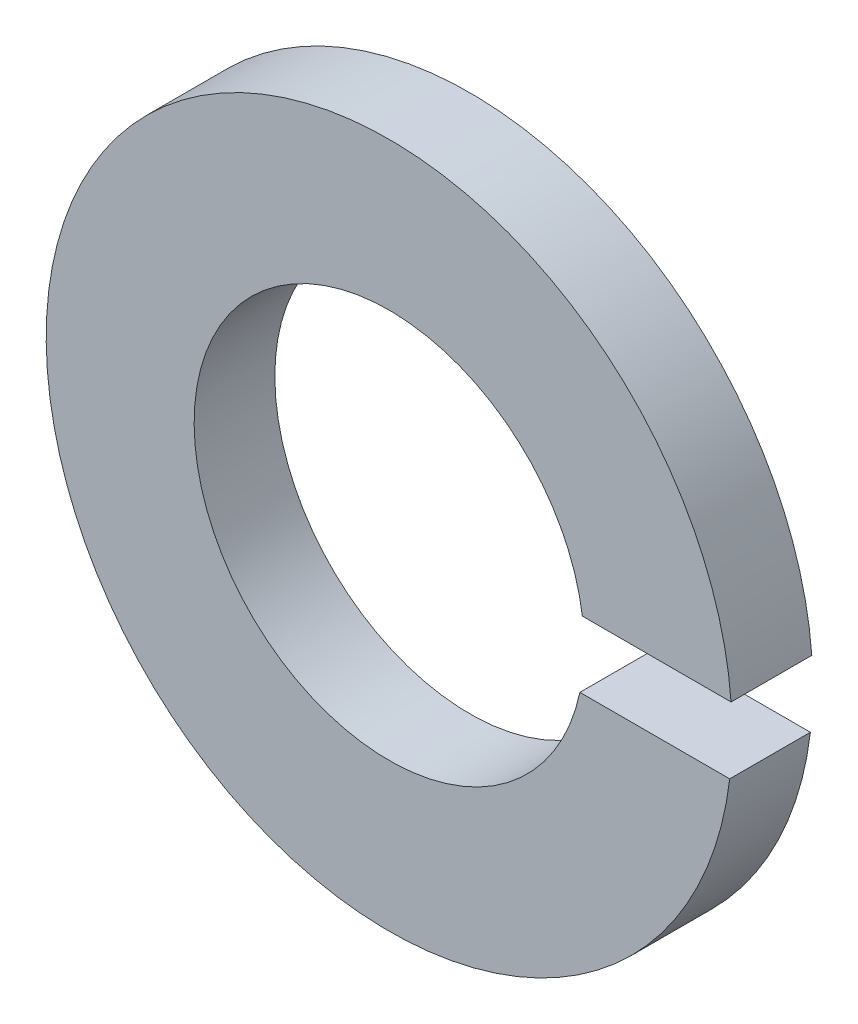
ISO-10303-21;
HEADER;
FILE_DESCRIPTION(('STEP AP214'),'2;1');
FILE_NAME('part.step','',(''),(''),'','','');
FILE_SCHEMA(('AUTOMOTIVE_DESIGN { 1 0 10303 214 1 1 1 1 }'));
ENDSEC;
DATA;
#1=APPLICATION_CONTEXT('core data for automotive mechanical design processes');
#2=APPLICATION_PROTOCOL_DEFINITION('international standard','automotive_design',2000,#1);
#3=PRODUCT_CONTEXT('',#1,'mechanical');
#4=PRODUCT('Part','Part','',(#3));
#5=PRODUCT_RELATED_PRODUCT_CATEGORY('part','',(#4));
#6=PRODUCT_DEFINITION_FORMATION('','',#4);
#7=PRODUCT_DEFINITION_CONTEXT('part definition',#1,'design');
#8=PRODUCT_DEFINITION('design','',#6,#7);
#9=PRODUCT_DEFINITION_SHAPE('','',#8);
#10=(LENGTH_UNIT() NAMED_UNIT(*) SI_UNIT(.MILLI.,.METRE.));
#11=(NAMED_UNIT(*) PLANE_ANGLE_UNIT() SI_UNIT($,.RADIAN.));
#12=(NAMED_UNIT(*) SI_UNIT($,.STERADIAN.) SOLID_ANGLE_UNIT());
#13=UNCERTAINTY_MEASURE_WITH_UNIT(LENGTH_MEASURE(1.E-05),#10,'distance_accuracy_value','');
#14=(GEOMETRIC_REPRESENTATION_CONTEXT(3) GLOBAL_UNCERTAINTY_ASSIGNED_CONTEXT((#13)) GLOBAL_UNIT_ASSIGNED_CONTEXT((#10,
#11,#12)) REPRESENTATION_CONTEXT('',''));
#15=CARTESIAN_POINT('',(0.,0.,0.));
#16=DIRECTION('',(0.,0.,1.));
#17=DIRECTION('',(1.,0.,0.));
#18=AXIS2_PLACEMENT_3D('',#15,#16,#17);
#19=CARTESIAN_POINT('',(0.,0.197779353039688,0.6));
#20=DIRECTION('',(0.,-1.,0.));
#21=DIRECTION('',(0.,0.,-1.));
#22=AXIS2_PLACEMENT_3D('',#19,#20,#21);
#23=PLANE('',#22);
#24=DIRECTION('',(-1.,0.,0.));
#25=VECTOR('',#24,1.);
#26=CARTESIAN_POINT('',(0.,0.197779353039688,0.));
#27=LINE('',#26,#25);
#28=CARTESIAN_POINT('',(2.54231849450678,0.197779353039688,0.));
#29=VERTEX_POINT('',#28);
#30=CARTESIAN_POINT('',(1.43644816387895,0.197779353039688,0.));
#31=VERTEX_POINT('',#30);
#32=EDGE_CURVE('E98',#29,#31,#27,.T.);
#33=ORIENTED_EDGE('',*,*,#32,.F.);
#34=DIRECTION('',(0.,0.,-1.));
#35=VECTOR('',#34,1.);
#36=CARTESIAN_POINT('',(2.54231849450678,0.197779353039688,0.6));
#37=LINE('',#36,#35);
#38=CARTESIAN_POINT('',(2.54231849450678,0.197779353039688,0.6));
#39=VERTEX_POINT('',#38);
#40=EDGE_CURVE('E11',#39,#29,#37,.T.);
#41=ORIENTED_EDGE('',*,*,#40,.F.);
#42=DIRECTION('',(-1.,0.,0.));
#43=VECTOR('',#42,1.);
#44=CARTESIAN_POINT('',(0.,0.197779353039688,0.6));
#45=LINE('',#44,#43);
#46=CARTESIAN_POINT('',(1.43644816387895,0.197779353039688,0.6));
#47=VERTEX_POINT('',#46);
#48=EDGE_CURVE('E83',#39,#47,#45,.T.);
#49=ORIENTED_EDGE('',*,*,#48,.T.);
#50=DIRECTION('',(0.,0.,-1.));
#51=VECTOR('',#50,1.);
#52=CARTESIAN_POINT('',(1.43644816387895,0.197779353039688,0.6));
#53=LINE('',#52,#51);
#54=EDGE_CURVE('E51',#47,#31,#53,.T.);
#55=ORIENTED_EDGE('',*,*,#54,.T.);
#56=EDGE_LOOP('',(#33,#41,#49,#55));
#57=FACE_BOUND('',#56,.T.);
#58=ADVANCED_FACE('F35',(#57),#23,.T.);
#59=CARTESIAN_POINT('',(0.,0.,0.6));
#60=DIRECTION('',(0.,0.,-1.));
#61=DIRECTION('',(-1.,0.,0.));
#62=AXIS2_PLACEMENT_3D('',#59,#60,#61);
#63=CYLINDRICAL_SURFACE('',#62,2.55);
#64=CARTESIAN_POINT('',(0.,0.,0.));
#65=DIRECTION('',(0.,0.,1.));
#66=DIRECTION('',(1.,0.,0.));
#67=AXIS2_PLACEMENT_3D('',#64,#65,#66);
#68=CIRCLE('',#67,2.55);
#69=CARTESIAN_POINT('',(2.53202738542672,-0.302220646960312,0.));
#70=VERTEX_POINT('',#69);
#71=EDGE_CURVE('E89',#29,#70,#68,.T.);
#72=ORIENTED_EDGE('',*,*,#71,.T.);
#73=DIRECTION('',(0.,0.,-1.));
#74=VECTOR('',#73,1.);
#75=CARTESIAN_POINT('',(2.53202738542672,-0.302220646960312,0.6));
#76=LINE('',#75,#74);
#77=CARTESIAN_POINT('',(2.53202738542672,-0.302220646960312,0.6));
#78=VERTEX_POINT('',#77);
#79=EDGE_CURVE('E43',#78,#70,#76,.T.);
#80=ORIENTED_EDGE('',*,*,#79,.F.);
#81=CARTESIAN_POINT('',(0.,0.,0.6));
#82=DIRECTION('',(0.,0.,1.));
#83=DIRECTION('',(1.,0.,0.));
#84=AXIS2_PLACEMENT_3D('',#81,#82,#83);
#85=CIRCLE('',#84,2.55);
#86=EDGE_CURVE('E77',#39,#78,#85,.T.);
#87=ORIENTED_EDGE('',*,*,#86,.F.);
#88=ORIENTED_EDGE('',*,*,#40,.T.);
#89=EDGE_LOOP('',(#72,#80,#87,#88));
#90=FACE_BOUND('',#89,.T.);
#91=ADVANCED_FACE('F87',(#90),#63,.T.);
#92=CARTESIAN_POINT('',(0.,-0.302220646960312,0.6));
#93=DIRECTION('',(0.,-1.,0.));
#94=DIRECTION('',(0.,0.,-1.));
#95=AXIS2_PLACEMENT_3D('',#92,#93,#94);
#96=PLANE('',#95);
#97=DIRECTION('',(-1.,0.,0.));
#98=VECTOR('',#97,1.);
#99=CARTESIAN_POINT('',(0.,-0.302220646960312,0.));
#100=LINE('',#99,#98);
#101=CARTESIAN_POINT('',(1.41815467440998,-0.302220646960312,0.));
#102=VERTEX_POINT('',#101);
#103=EDGE_CURVE('E101',#70,#102,#100,.T.);
#104=ORIENTED_EDGE('',*,*,#103,.T.);
#105=DIRECTION('',(0.,0.,-1.));
#106=VECTOR('',#105,1.);
#107=CARTESIAN_POINT('',(1.41815467440998,-0.302220646960312,0.6));
#108=LINE('',#107,#106);
#109=CARTESIAN_POINT('',(1.41815467440998,-0.302220646960312,0.6));
#110=VERTEX_POINT('',#109);
#111=EDGE_CURVE('E65',#110,#102,#108,.T.);
#112=ORIENTED_EDGE('',*,*,#111,.F.);
#113=DIRECTION('',(-1.,0.,0.));
#114=VECTOR('',#113,1.);
#115=CARTESIAN_POINT('',(0.,-0.302220646960312,0.6));
#116=LINE('',#115,#114);
#117=EDGE_CURVE('E82',#78,#110,#116,.T.);
#118=ORIENTED_EDGE('',*,*,#117,.F.);
#119=ORIENTED_EDGE('',*,*,#79,.T.);
#120=EDGE_LOOP('',(#104,#112,#118,#119));
#121=FACE_BOUND('',#120,.T.);
#122=ADVANCED_FACE('F92',(#121),#96,.F.);
#123=CARTESIAN_POINT('',(0.,0.,0.6));
#124=DIRECTION('',(0.,0.,-1.));
#125=DIRECTION('',(-1.,0.,0.));
#126=AXIS2_PLACEMENT_3D('',#123,#124,#125);
#127=CYLINDRICAL_SURFACE('',#126,1.45);
#128=CARTESIAN_POINT('',(0.,0.,0.));
#129=DIRECTION('',(0.,0.,1.));
#130=DIRECTION('',(1.,0.,0.));
#131=AXIS2_PLACEMENT_3D('',#128,#129,#130);
#132=CIRCLE('',#131,1.45);
#133=EDGE_CURVE('E103',#31,#102,#132,.T.);
#134=ORIENTED_EDGE('',*,*,#133,.F.);
#135=ORIENTED_EDGE('',*,*,#54,.F.);
#136=CARTESIAN_POINT('',(0.,0.,0.6));
#137=DIRECTION('',(0.,0.,1.));
#138=DIRECTION('',(1.,0.,0.));
#139=AXIS2_PLACEMENT_3D('',#136,#137,#138);
#140=CIRCLE('',#139,1.45);
#141=EDGE_CURVE('E93',#47,#110,#140,.T.);
#142=ORIENTED_EDGE('',*,*,#141,.T.);
#143=ORIENTED_EDGE('',*,*,#111,.T.);
#144=EDGE_LOOP('',(#134,#135,#142,#143));
#145=FACE_BOUND('',#144,.T.);
#146=ADVANCED_FACE('F108',(#145),#127,.F.);
#147=CARTESIAN_POINT('',(0.,0.,0.6));
#148=DIRECTION('',(0.,0.,1.));
#149=DIRECTION('',(1.,0.,0.));
#150=AXIS2_PLACEMENT_3D('',#147,#148,#149);
#151=PLANE('',#150);
#152=ORIENTED_EDGE('',*,*,#48,.F.);
#153=ORIENTED_EDGE('',*,*,#86,.T.);
#154=ORIENTED_EDGE('',*,*,#117,.T.);
#155=ORIENTED_EDGE('',*,*,#141,.F.);
#156=EDGE_LOOP('',(#152,#153,#154,#155));
#157=FACE_BOUND('',#156,.T.);
#158=ADVANCED_FACE('F79',(#157),#151,.T.);
#159=CARTESIAN_POINT('',(0.,0.,0.));
#160=DIRECTION('',(0.,0.,1.));
#161=DIRECTION('',(1.,0.,0.));
#162=AXIS2_PLACEMENT_3D('',#159,#160,#161);
#163=PLANE('',#162);
#164=ORIENTED_EDGE('',*,*,#32,.T.);
#165=ORIENTED_EDGE('',*,*,#133,.T.);
#166=ORIENTED_EDGE('',*,*,#103,.F.);
#167=ORIENTED_EDGE('',*,*,#71,.F.);
#168=EDGE_LOOP('',(#164,#165,#166,#167));
#169=FACE_BOUND('',#168,.T.);
#170=ADVANCED_FACE('F115',(#169),#163,.F.);
#171=CLOSED_SHELL('',(#58,#91,#122,#146,#158,#170));
#172=MANIFOLD_SOLID_BREP('B2',#171);
#173=ADVANCED_BREP_SHAPE_REPRESENTATION('',(#18,#172),#14);
#174=SHAPE_DEFINITION_REPRESENTATION(#9,#173);
ENDSEC;
END-ISO-10303-21;
